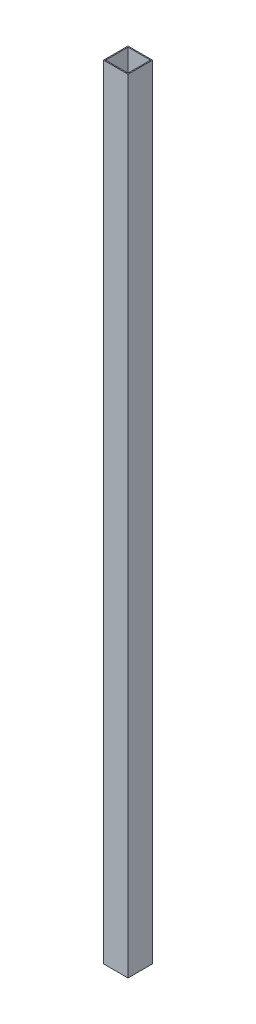
ISO-10303-21;
HEADER;
FILE_DESCRIPTION(('STEP AP214'),'2;1');
FILE_NAME('part.step','',(''),(''),'','','');
FILE_SCHEMA(('AUTOMOTIVE_DESIGN { 1 0 10303 214 1 1 1 1 }'));
ENDSEC;
DATA;
#1=APPLICATION_CONTEXT('core data for automotive mechanical design processes');
#2=APPLICATION_PROTOCOL_DEFINITION('international standard','automotive_design',2000,#1);
#3=PRODUCT_CONTEXT('',#1,'mechanical');
#4=PRODUCT('Part','Part','',(#3));
#5=PRODUCT_RELATED_PRODUCT_CATEGORY('part','',(#4));
#6=PRODUCT_DEFINITION_FORMATION('','',#4);
#7=PRODUCT_DEFINITION_CONTEXT('part definition',#1,'design');
#8=PRODUCT_DEFINITION('design','',#6,#7);
#9=PRODUCT_DEFINITION_SHAPE('','',#8);
#10=(LENGTH_UNIT() NAMED_UNIT(*) SI_UNIT(.MILLI.,.METRE.));
#11=(NAMED_UNIT(*) PLANE_ANGLE_UNIT() SI_UNIT($,.RADIAN.));
#12=(NAMED_UNIT(*) SI_UNIT($,.STERADIAN.) SOLID_ANGLE_UNIT());
#13=UNCERTAINTY_MEASURE_WITH_UNIT(LENGTH_MEASURE(1.E-05),#10,'distance_accuracy_value','');
#14=(GEOMETRIC_REPRESENTATION_CONTEXT(3) GLOBAL_UNCERTAINTY_ASSIGNED_CONTEXT((#13)) GLOBAL_UNIT_ASSIGNED_CONTEXT((#10,
#11,#12)) REPRESENTATION_CONTEXT('',''));
#15=CARTESIAN_POINT('',(0.,0.,0.));
#16=DIRECTION('',(0.,0.,1.));
#17=DIRECTION('',(1.,0.,0.));
#18=AXIS2_PLACEMENT_3D('',#15,#16,#17);
#19=CARTESIAN_POINT('',(0.,2438.4,0.));
#20=DIRECTION('',(0.,1.,0.));
#21=DIRECTION('',(0.,0.,1.));
#22=AXIS2_PLACEMENT_3D('',#19,#20,#21);
#23=PLANE('',#22);
#24=DIRECTION('',(0.,0.,-1.));
#25=VECTOR('',#24,1.);
#26=CARTESIAN_POINT('',(38.1,2438.4,-38.1));
#27=LINE('',#26,#25);
#28=CARTESIAN_POINT('',(38.1,2438.4,38.1));
#29=VERTEX_POINT('',#28);
#30=CARTESIAN_POINT('',(38.1,2438.4,-38.1));
#31=VERTEX_POINT('',#30);
#32=EDGE_CURVE('E159',#29,#31,#27,.T.);
#33=ORIENTED_EDGE('',*,*,#32,.T.);
#34=DIRECTION('',(-1.,0.,0.));
#35=VECTOR('',#34,1.);
#36=CARTESIAN_POINT('',(-38.1,2438.4,-38.1));
#37=LINE('',#36,#35);
#38=CARTESIAN_POINT('',(-38.1,2438.4,-38.1));
#39=VERTEX_POINT('',#38);
#40=EDGE_CURVE('E163',#31,#39,#37,.T.);
#41=ORIENTED_EDGE('',*,*,#40,.T.);
#42=DIRECTION('',(0.,0.,1.));
#43=VECTOR('',#42,1.);
#44=CARTESIAN_POINT('',(-38.1,2438.4,-38.1));
#45=LINE('',#44,#43);
#46=CARTESIAN_POINT('',(-38.1,2438.4,38.1));
#47=VERTEX_POINT('',#46);
#48=EDGE_CURVE('E167',#39,#47,#45,.T.);
#49=ORIENTED_EDGE('',*,*,#48,.T.);
#50=DIRECTION('',(1.,0.,0.));
#51=VECTOR('',#50,1.);
#52=CARTESIAN_POINT('',(-38.1,2438.4,38.1));
#53=LINE('',#52,#51);
#54=EDGE_CURVE('E170',#47,#29,#53,.T.);
#55=ORIENTED_EDGE('',*,*,#54,.T.);
#56=EDGE_LOOP('',(#33,#41,#49,#55));
#57=FACE_BOUND('',#56,.T.);
#58=DIRECTION('',(-1.,0.,0.));
#59=VECTOR('',#58,1.);
#60=CARTESIAN_POINT('',(-35.052,2438.4,-35.052));
#61=LINE('',#60,#59);
#62=CARTESIAN_POINT('',(35.052,2438.4,-35.052));
#63=VERTEX_POINT('',#62);
#64=CARTESIAN_POINT('',(-35.052,2438.4,-35.052));
#65=VERTEX_POINT('',#64);
#66=EDGE_CURVE('E120',#63,#65,#61,.T.);
#67=ORIENTED_EDGE('',*,*,#66,.F.);
#68=DIRECTION('',(0.,0.,-1.));
#69=VECTOR('',#68,1.);
#70=CARTESIAN_POINT('',(35.052,2438.4,-35.052));
#71=LINE('',#70,#69);
#72=CARTESIAN_POINT('',(35.052,2438.4,35.052));
#73=VERTEX_POINT('',#72);
#74=EDGE_CURVE('E111',#73,#63,#71,.T.);
#75=ORIENTED_EDGE('',*,*,#74,.F.);
#76=DIRECTION('',(1.,0.,0.));
#77=VECTOR('',#76,1.);
#78=CARTESIAN_POINT('',(-35.052,2438.4,35.052));
#79=LINE('',#78,#77);
#80=CARTESIAN_POINT('',(-35.052,2438.4,35.052));
#81=VERTEX_POINT('',#80);
#82=EDGE_CURVE('E137',#81,#73,#79,.T.);
#83=ORIENTED_EDGE('',*,*,#82,.F.);
#84=DIRECTION('',(0.,0.,1.));
#85=VECTOR('',#84,1.);
#86=CARTESIAN_POINT('',(-35.052,2438.4,-35.052));
#87=LINE('',#86,#85);
#88=EDGE_CURVE('E133',#65,#81,#87,.T.);
#89=ORIENTED_EDGE('',*,*,#88,.F.);
#90=EDGE_LOOP('',(#67,#75,#83,#89));
#91=FACE_BOUND('',#90,.T.);
#92=ADVANCED_FACE('F45',(#57,#91),#23,.T.);
#93=CARTESIAN_POINT('',(0.,0.,0.));
#94=DIRECTION('',(0.,1.,0.));
#95=DIRECTION('',(0.,0.,1.));
#96=AXIS2_PLACEMENT_3D('',#93,#94,#95);
#97=PLANE('',#96);
#98=DIRECTION('',(0.,0.,-1.));
#99=VECTOR('',#98,1.);
#100=CARTESIAN_POINT('',(38.1,0.,-38.1));
#101=LINE('',#100,#99);
#102=CARTESIAN_POINT('',(38.1,0.,38.1));
#103=VERTEX_POINT('',#102);
#104=CARTESIAN_POINT('',(38.1,0.,-38.1));
#105=VERTEX_POINT('',#104);
#106=EDGE_CURVE('E129',#103,#105,#101,.T.);
#107=ORIENTED_EDGE('',*,*,#106,.F.);
#108=DIRECTION('',(1.,0.,0.));
#109=VECTOR('',#108,1.);
#110=CARTESIAN_POINT('',(-38.1,0.,38.1));
#111=LINE('',#110,#109);
#112=CARTESIAN_POINT('',(-38.1,0.,38.1));
#113=VERTEX_POINT('',#112);
#114=EDGE_CURVE('E164',#113,#103,#111,.T.);
#115=ORIENTED_EDGE('',*,*,#114,.F.);
#116=DIRECTION('',(0.,0.,1.));
#117=VECTOR('',#116,1.);
#118=CARTESIAN_POINT('',(-38.1,0.,-38.1));
#119=LINE('',#118,#117);
#120=CARTESIAN_POINT('',(-38.1,0.,-38.1));
#121=VERTEX_POINT('',#120);
#122=EDGE_CURVE('E180',#121,#113,#119,.T.);
#123=ORIENTED_EDGE('',*,*,#122,.F.);
#124=DIRECTION('',(-1.,0.,0.));
#125=VECTOR('',#124,1.);
#126=CARTESIAN_POINT('',(-38.1,0.,-38.1));
#127=LINE('',#126,#125);
#128=EDGE_CURVE('E177',#105,#121,#127,.T.);
#129=ORIENTED_EDGE('',*,*,#128,.F.);
#130=EDGE_LOOP('',(#107,#115,#123,#129));
#131=FACE_BOUND('',#130,.T.);
#132=DIRECTION('',(0.,0.,-1.));
#133=VECTOR('',#132,1.);
#134=CARTESIAN_POINT('',(35.052,0.,-35.052));
#135=LINE('',#134,#133);
#136=CARTESIAN_POINT('',(35.052,0.,35.052));
#137=VERTEX_POINT('',#136);
#138=CARTESIAN_POINT('',(35.052,0.,-35.052));
#139=VERTEX_POINT('',#138);
#140=EDGE_CURVE('E69',#137,#139,#135,.T.);
#141=ORIENTED_EDGE('',*,*,#140,.T.);
#142=DIRECTION('',(-1.,0.,0.));
#143=VECTOR('',#142,1.);
#144=CARTESIAN_POINT('',(-35.052,0.,-35.052));
#145=LINE('',#144,#143);
#146=CARTESIAN_POINT('',(-35.052,0.,-35.052));
#147=VERTEX_POINT('',#146);
#148=EDGE_CURVE('E127',#139,#147,#145,.T.);
#149=ORIENTED_EDGE('',*,*,#148,.T.);
#150=DIRECTION('',(0.,0.,1.));
#151=VECTOR('',#150,1.);
#152=CARTESIAN_POINT('',(-35.052,0.,-35.052));
#153=LINE('',#152,#151);
#154=CARTESIAN_POINT('',(-35.052,0.,35.052));
#155=VERTEX_POINT('',#154);
#156=EDGE_CURVE('E146',#147,#155,#153,.T.);
#157=ORIENTED_EDGE('',*,*,#156,.T.);
#158=DIRECTION('',(1.,0.,0.));
#159=VECTOR('',#158,1.);
#160=CARTESIAN_POINT('',(-35.052,0.,35.052));
#161=LINE('',#160,#159);
#162=EDGE_CURVE('E121',#155,#137,#161,.T.);
#163=ORIENTED_EDGE('',*,*,#162,.T.);
#164=EDGE_LOOP('',(#141,#149,#157,#163));
#165=FACE_BOUND('',#164,.T.);
#166=ADVANCED_FACE('F203',(#131,#165),#97,.F.);
#167=CARTESIAN_POINT('',(38.1,2438.4,-38.1));
#168=DIRECTION('',(-1.,0.,0.));
#169=DIRECTION('',(0.,0.,1.));
#170=AXIS2_PLACEMENT_3D('',#167,#168,#169);
#171=PLANE('',#170);
#172=ORIENTED_EDGE('',*,*,#106,.T.);
#173=DIRECTION('',(0.,-1.,0.));
#174=VECTOR('',#173,1.);
#175=CARTESIAN_POINT('',(38.1,2438.4,-38.1));
#176=LINE('',#175,#174);
#177=EDGE_CURVE('E11',#31,#105,#176,.T.);
#178=ORIENTED_EDGE('',*,*,#177,.F.);
#179=ORIENTED_EDGE('',*,*,#32,.F.);
#180=DIRECTION('',(0.,-1.,0.));
#181=VECTOR('',#180,1.);
#182=CARTESIAN_POINT('',(38.1,2438.4,38.1));
#183=LINE('',#182,#181);
#184=EDGE_CURVE('E173',#29,#103,#183,.T.);
#185=ORIENTED_EDGE('',*,*,#184,.T.);
#186=EDGE_LOOP('',(#172,#178,#179,#185));
#187=FACE_BOUND('',#186,.T.);
#188=ADVANCED_FACE('F47',(#187),#171,.F.);
#189=CARTESIAN_POINT('',(-38.1,2438.4,-38.1));
#190=DIRECTION('',(0.,0.,1.));
#191=DIRECTION('',(1.,0.,0.));
#192=AXIS2_PLACEMENT_3D('',#189,#190,#191);
#193=PLANE('',#192);
#194=ORIENTED_EDGE('',*,*,#128,.T.);
#195=DIRECTION('',(0.,-1.,0.));
#196=VECTOR('',#195,1.);
#197=CARTESIAN_POINT('',(-38.1,2438.4,-38.1));
#198=LINE('',#197,#196);
#199=EDGE_CURVE('E54',#39,#121,#198,.T.);
#200=ORIENTED_EDGE('',*,*,#199,.F.);
#201=ORIENTED_EDGE('',*,*,#40,.F.);
#202=ORIENTED_EDGE('',*,*,#177,.T.);
#203=EDGE_LOOP('',(#194,#200,#201,#202));
#204=FACE_BOUND('',#203,.T.);
#205=ADVANCED_FACE('F213',(#204),#193,.F.);
#206=CARTESIAN_POINT('',(-38.1,2438.4,-38.1));
#207=DIRECTION('',(1.,0.,0.));
#208=DIRECTION('',(0.,0.,-1.));
#209=AXIS2_PLACEMENT_3D('',#206,#207,#208);
#210=PLANE('',#209);
#211=ORIENTED_EDGE('',*,*,#122,.T.);
#212=DIRECTION('',(0.,-1.,0.));
#213=VECTOR('',#212,1.);
#214=CARTESIAN_POINT('',(-38.1,2438.4,38.1));
#215=LINE('',#214,#213);
#216=EDGE_CURVE('E188',#47,#113,#215,.T.);
#217=ORIENTED_EDGE('',*,*,#216,.F.);
#218=ORIENTED_EDGE('',*,*,#48,.F.);
#219=ORIENTED_EDGE('',*,*,#199,.T.);
#220=EDGE_LOOP('',(#211,#217,#218,#219));
#221=FACE_BOUND('',#220,.T.);
#222=ADVANCED_FACE('F197',(#221),#210,.F.);
#223=CARTESIAN_POINT('',(-38.1,2438.4,38.1));
#224=DIRECTION('',(0.,0.,-1.));
#225=DIRECTION('',(-1.,0.,0.));
#226=AXIS2_PLACEMENT_3D('',#223,#224,#225);
#227=PLANE('',#226);
#228=ORIENTED_EDGE('',*,*,#114,.T.);
#229=ORIENTED_EDGE('',*,*,#184,.F.);
#230=ORIENTED_EDGE('',*,*,#54,.F.);
#231=ORIENTED_EDGE('',*,*,#216,.T.);
#232=EDGE_LOOP('',(#228,#229,#230,#231));
#233=FACE_BOUND('',#232,.T.);
#234=ADVANCED_FACE('F207',(#233),#227,.F.);
#235=CARTESIAN_POINT('',(35.052,2438.4,-35.052));
#236=DIRECTION('',(-1.,0.,0.));
#237=DIRECTION('',(0.,0.,1.));
#238=AXIS2_PLACEMENT_3D('',#235,#236,#237);
#239=PLANE('',#238);
#240=ORIENTED_EDGE('',*,*,#140,.F.);
#241=DIRECTION('',(0.,-1.,0.));
#242=VECTOR('',#241,1.);
#243=CARTESIAN_POINT('',(35.052,2438.4,35.052));
#244=LINE('',#243,#242);
#245=EDGE_CURVE('E115',#73,#137,#244,.T.);
#246=ORIENTED_EDGE('',*,*,#245,.F.);
#247=ORIENTED_EDGE('',*,*,#74,.T.);
#248=DIRECTION('',(0.,-1.,0.));
#249=VECTOR('',#248,1.);
#250=CARTESIAN_POINT('',(35.052,2438.4,-35.052));
#251=LINE('',#250,#249);
#252=EDGE_CURVE('E114',#63,#139,#251,.T.);
#253=ORIENTED_EDGE('',*,*,#252,.T.);
#254=EDGE_LOOP('',(#240,#246,#247,#253));
#255=FACE_BOUND('',#254,.T.);
#256=ADVANCED_FACE('F113',(#255),#239,.T.);
#257=CARTESIAN_POINT('',(-35.052,2438.4,-35.052));
#258=DIRECTION('',(0.,0.,1.));
#259=DIRECTION('',(1.,0.,0.));
#260=AXIS2_PLACEMENT_3D('',#257,#258,#259);
#261=PLANE('',#260);
#262=ORIENTED_EDGE('',*,*,#148,.F.);
#263=ORIENTED_EDGE('',*,*,#252,.F.);
#264=ORIENTED_EDGE('',*,*,#66,.T.);
#265=DIRECTION('',(0.,-1.,0.));
#266=VECTOR('',#265,1.);
#267=CARTESIAN_POINT('',(-35.052,2438.4,-35.052));
#268=LINE('',#267,#266);
#269=EDGE_CURVE('E130',#65,#147,#268,.T.);
#270=ORIENTED_EDGE('',*,*,#269,.T.);
#271=EDGE_LOOP('',(#262,#263,#264,#270));
#272=FACE_BOUND('',#271,.T.);
#273=ADVANCED_FACE('F124',(#272),#261,.T.);
#274=CARTESIAN_POINT('',(-35.052,2438.4,-35.052));
#275=DIRECTION('',(1.,0.,0.));
#276=DIRECTION('',(0.,0.,-1.));
#277=AXIS2_PLACEMENT_3D('',#274,#275,#276);
#278=PLANE('',#277);
#279=ORIENTED_EDGE('',*,*,#156,.F.);
#280=ORIENTED_EDGE('',*,*,#269,.F.);
#281=ORIENTED_EDGE('',*,*,#88,.T.);
#282=DIRECTION('',(0.,-1.,0.));
#283=VECTOR('',#282,1.);
#284=CARTESIAN_POINT('',(-35.052,2438.4,35.052));
#285=LINE('',#284,#283);
#286=EDGE_CURVE('E61',#81,#155,#285,.T.);
#287=ORIENTED_EDGE('',*,*,#286,.T.);
#288=EDGE_LOOP('',(#279,#280,#281,#287));
#289=FACE_BOUND('',#288,.T.);
#290=ADVANCED_FACE('F236',(#289),#278,.T.);
#291=CARTESIAN_POINT('',(-35.052,2438.4,35.052));
#292=DIRECTION('',(0.,0.,-1.));
#293=DIRECTION('',(-1.,0.,0.));
#294=AXIS2_PLACEMENT_3D('',#291,#292,#293);
#295=PLANE('',#294);
#296=ORIENTED_EDGE('',*,*,#162,.F.);
#297=ORIENTED_EDGE('',*,*,#286,.F.);
#298=ORIENTED_EDGE('',*,*,#82,.T.);
#299=ORIENTED_EDGE('',*,*,#245,.T.);
#300=EDGE_LOOP('',(#296,#297,#298,#299));
#301=FACE_BOUND('',#300,.T.);
#302=ADVANCED_FACE('F240',(#301),#295,.T.);
#303=CLOSED_SHELL('',(#92,#166,#188,#205,#222,#234,#256,#273,#290,#302));
#304=MANIFOLD_SOLID_BREP('B2',#303);
#305=ADVANCED_BREP_SHAPE_REPRESENTATION('',(#18,#304),#14);
#306=SHAPE_DEFINITION_REPRESENTATION(#9,#305);
ENDSEC;
END-ISO-10303-21;
